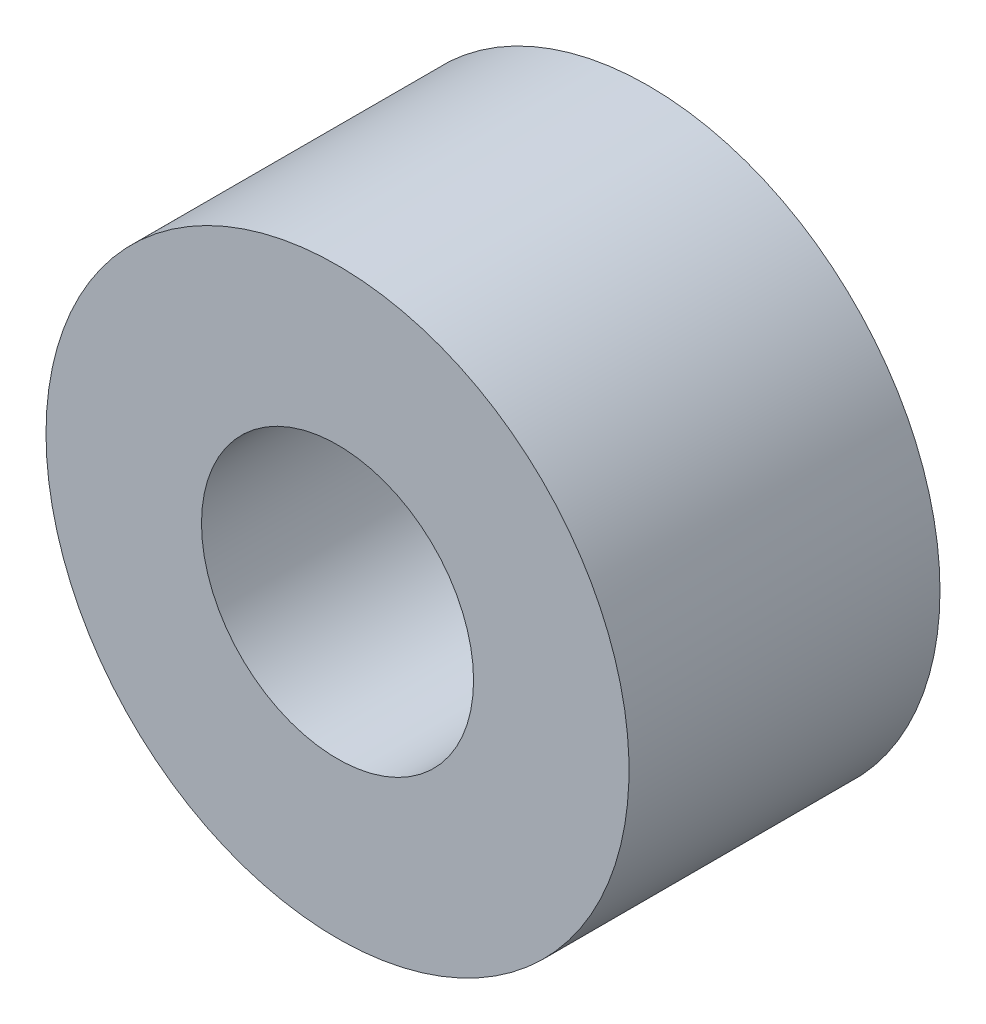
ISO-10303-21;
HEADER;
FILE_DESCRIPTION(('STEP AP214'),'2;1');
FILE_NAME('part.step','',(''),(''),'','','');
FILE_SCHEMA(('AUTOMOTIVE_DESIGN { 1 0 10303 214 1 1 1 1 }'));
ENDSEC;
DATA;
#1=APPLICATION_CONTEXT('core data for automotive mechanical design processes');
#2=APPLICATION_PROTOCOL_DEFINITION('international standard','automotive_design',2000,#1);
#3=PRODUCT_CONTEXT('',#1,'mechanical');
#4=PRODUCT('Part','Part','',(#3));
#5=PRODUCT_RELATED_PRODUCT_CATEGORY('part','',(#4));
#6=PRODUCT_DEFINITION_FORMATION('','',#4);
#7=PRODUCT_DEFINITION_CONTEXT('part definition',#1,'design');
#8=PRODUCT_DEFINITION('design','',#6,#7);
#9=PRODUCT_DEFINITION_SHAPE('','',#8);
#10=(LENGTH_UNIT() NAMED_UNIT(*) SI_UNIT(.MILLI.,.METRE.));
#11=(NAMED_UNIT(*) PLANE_ANGLE_UNIT() SI_UNIT($,.RADIAN.));
#12=(NAMED_UNIT(*) SI_UNIT($,.STERADIAN.) SOLID_ANGLE_UNIT());
#13=UNCERTAINTY_MEASURE_WITH_UNIT(LENGTH_MEASURE(1.E-05),#10,'distance_accuracy_value','');
#14=(GEOMETRIC_REPRESENTATION_CONTEXT(3) GLOBAL_UNCERTAINTY_ASSIGNED_CONTEXT((#13)) GLOBAL_UNIT_ASSIGNED_CONTEXT((#10,
#11,#12)) REPRESENTATION_CONTEXT('',''));
#15=CARTESIAN_POINT('',(0.,0.,0.));
#16=DIRECTION('',(0.,0.,1.));
#17=DIRECTION('',(1.,0.,0.));
#18=AXIS2_PLACEMENT_3D('',#15,#16,#17);
#19=CARTESIAN_POINT('',(1.45849998745007E-13,5.8,0.));
#20=DIRECTION('',(0.,0.,1.));
#21=DIRECTION('',(1.,0.,0.));
#22=AXIS2_PLACEMENT_3D('',#19,#20,#21);
#23=PLANE('',#22);
#24=CARTESIAN_POINT('',(1.45849998745007E-13,5.8,0.));
#25=DIRECTION('',(0.,0.,1.));
#26=DIRECTION('',(1.,0.,0.));
#27=AXIS2_PLACEMENT_3D('',#24,#25,#26);
#28=CIRCLE('',#27,11.25);
#29=CARTESIAN_POINT('',(11.2500000000002,5.8,0.));
#30=VERTEX_POINT('',#29);
#31=EDGE_CURVE('E51',#30,#30,#28,.T.);
#32=ORIENTED_EDGE('',*,*,#31,.F.);
#33=EDGE_LOOP('',(#32));
#34=FACE_BOUND('',#33,.T.);
#35=CARTESIAN_POINT('',(-5.28036503411045E-12,5.80000000000216,0.));
#36=DIRECTION('',(0.,0.,1.));
#37=DIRECTION('',(1.,0.,0.));
#38=AXIS2_PLACEMENT_3D('',#35,#36,#37);
#39=CIRCLE('',#38,5.25);
#40=CARTESIAN_POINT('',(5.24999999999472,5.80000000000216,0.));
#41=VERTEX_POINT('',#40);
#42=EDGE_CURVE('E60',#41,#41,#39,.T.);
#43=ORIENTED_EDGE('',*,*,#42,.T.);
#44=EDGE_LOOP('',(#43));
#45=FACE_BOUND('',#44,.T.);
#46=ADVANCED_FACE('F44',(#34,#45),#23,.F.);
#47=CARTESIAN_POINT('',(1.45849998745007E-13,5.8,43.8198051533946));
#48=DIRECTION('',(0.,0.,-1.));
#49=DIRECTION('',(-1.,0.,0.));
#50=AXIS2_PLACEMENT_3D('',#47,#48,#49);
#51=CYLINDRICAL_SURFACE('',#50,11.25);
#52=CARTESIAN_POINT('',(1.45849998745007E-13,5.8,12.));
#53=DIRECTION('',(0.,0.,-1.));
#54=DIRECTION('',(-1.,0.,0.));
#55=AXIS2_PLACEMENT_3D('',#52,#53,#54);
#56=CIRCLE('',#55,11.25);
#57=CARTESIAN_POINT('',(-11.2499999999999,5.8,12.));
#58=VERTEX_POINT('',#57);
#59=EDGE_CURVE('E55',#58,#58,#56,.T.);
#60=ORIENTED_EDGE('',*,*,#59,.T.);
#61=EDGE_LOOP('',(#60));
#62=FACE_BOUND('',#61,.T.);
#63=ORIENTED_EDGE('',*,*,#31,.T.);
#64=EDGE_LOOP('',(#63));
#65=FACE_BOUND('',#64,.T.);
#66=ADVANCED_FACE('F68',(#62,#65),#51,.T.);
#67=CARTESIAN_POINT('',(-5.28036503411045E-12,5.80000000000216,43.8198051533946));
#68=DIRECTION('',(0.,0.,-1.));
#69=DIRECTION('',(-1.,0.,0.));
#70=AXIS2_PLACEMENT_3D('',#67,#68,#69);
#71=CYLINDRICAL_SURFACE('',#70,5.25);
#72=CARTESIAN_POINT('',(-5.28036503411045E-12,5.80000000000216,12.));
#73=DIRECTION('',(0.,0.,-1.));
#74=DIRECTION('',(-1.,0.,0.));
#75=AXIS2_PLACEMENT_3D('',#72,#73,#74);
#76=CIRCLE('',#75,5.25);
#77=CARTESIAN_POINT('',(-5.25000000000528,5.80000000000216,12.));
#78=VERTEX_POINT('',#77);
#79=EDGE_CURVE('E12',#78,#78,#76,.T.);
#80=ORIENTED_EDGE('',*,*,#79,.F.);
#81=EDGE_LOOP('',(#80));
#82=FACE_BOUND('',#81,.T.);
#83=ORIENTED_EDGE('',*,*,#42,.F.);
#84=EDGE_LOOP('',(#83));
#85=FACE_BOUND('',#84,.T.);
#86=ADVANCED_FACE('F66',(#82,#85),#71,.F.);
#87=CARTESIAN_POINT('',(-42.5000079798005,-8.99017652757489,12.));
#88=DIRECTION('',(0.,0.,-1.));
#89=DIRECTION('',(-0.999999999999855,5.39533527410541E-07,0.));
#90=AXIS2_PLACEMENT_3D('',#87,#88,#89);
#91=PLANE('',#90);
#92=ORIENTED_EDGE('',*,*,#79,.T.);
#93=EDGE_LOOP('',(#92));
#94=FACE_BOUND('',#93,.T.);
#95=ORIENTED_EDGE('',*,*,#59,.F.);
#96=EDGE_LOOP('',(#95));
#97=FACE_BOUND('',#96,.T.);
#98=ADVANCED_FACE('F46',(#94,#97),#91,.F.);
#99=CLOSED_SHELL('',(#46,#66,#86,#98));
#100=MANIFOLD_SOLID_BREP('B2',#99);
#101=ADVANCED_BREP_SHAPE_REPRESENTATION('',(#18,#100),#14);
#102=SHAPE_DEFINITION_REPRESENTATION(#9,#101);
ENDSEC;
END-ISO-10303-21;
